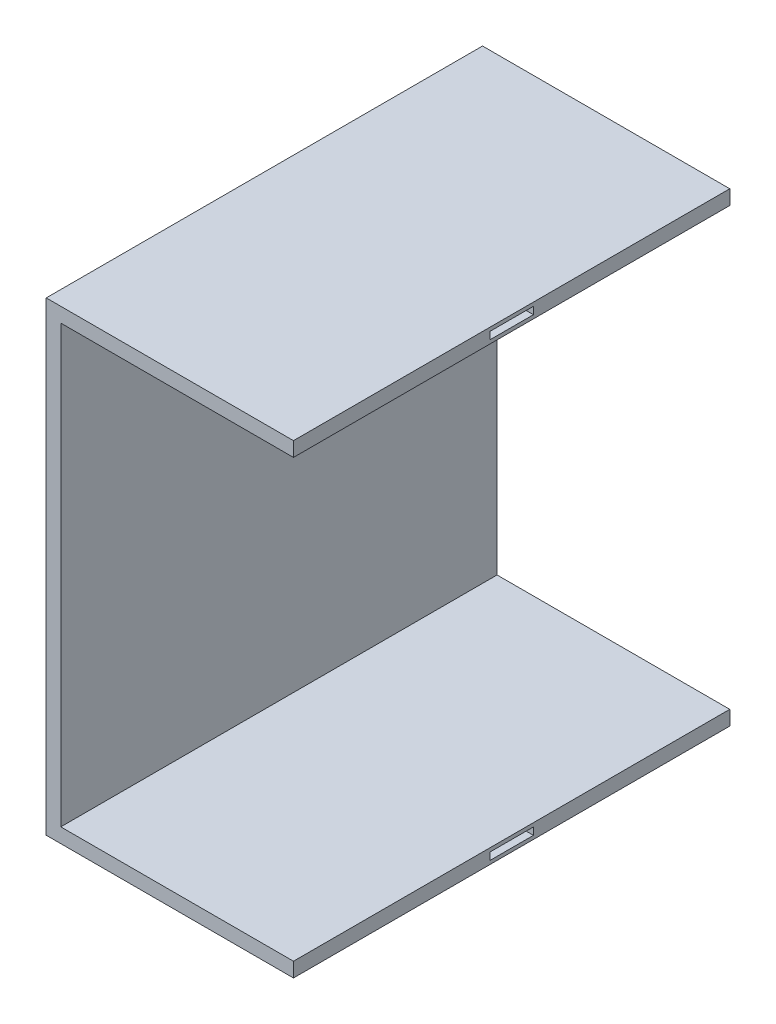
ISO-10303-21;
HEADER;
FILE_DESCRIPTION(('STEP AP214'),'2;1');
FILE_NAME('part.step','',(''),(''),'','','');
FILE_SCHEMA(('AUTOMOTIVE_DESIGN { 1 0 10303 214 1 1 1 1 }'));
ENDSEC;
DATA;
#1=APPLICATION_CONTEXT('core data for automotive mechanical design processes');
#2=APPLICATION_PROTOCOL_DEFINITION('international standard','automotive_design',2000,#1);
#3=PRODUCT_CONTEXT('',#1,'mechanical');
#4=PRODUCT('Part','Part','',(#3));
#5=PRODUCT_RELATED_PRODUCT_CATEGORY('part','',(#4));
#6=PRODUCT_DEFINITION_FORMATION('','',#4);
#7=PRODUCT_DEFINITION_CONTEXT('part definition',#1,'design');
#8=PRODUCT_DEFINITION('design','',#6,#7);
#9=PRODUCT_DEFINITION_SHAPE('','',#8);
#10=(LENGTH_UNIT() NAMED_UNIT(*) SI_UNIT(.MILLI.,.METRE.));
#11=(NAMED_UNIT(*) PLANE_ANGLE_UNIT() SI_UNIT($,.RADIAN.));
#12=(NAMED_UNIT(*) SI_UNIT($,.STERADIAN.) SOLID_ANGLE_UNIT());
#13=UNCERTAINTY_MEASURE_WITH_UNIT(LENGTH_MEASURE(1.E-05),#10,'distance_accuracy_value','');
#14=(GEOMETRIC_REPRESENTATION_CONTEXT(3) GLOBAL_UNCERTAINTY_ASSIGNED_CONTEXT((#13)) GLOBAL_UNIT_ASSIGNED_CONTEXT((#10,
#11,#12)) REPRESENTATION_CONTEXT('',''));
#15=CARTESIAN_POINT('',(0.,0.,0.));
#16=DIRECTION('',(0.,0.,1.));
#17=DIRECTION('',(1.,0.,0.));
#18=AXIS2_PLACEMENT_3D('',#15,#16,#17);
#19=CARTESIAN_POINT('',(0.,32.,15.));
#20=DIRECTION('',(1.,0.,0.));
#21=DIRECTION('',(0.,0.,-1.));
#22=AXIS2_PLACEMENT_3D('',#19,#20,#21);
#23=PLANE('',#22);
#24=CARTESIAN_POINT('',(0.,16.,0.));
#25=DIRECTION('',(1.,0.,0.));
#26=DIRECTION('',(0.,0.,-1.));
#27=AXIS2_PLACEMENT_3D('',#24,#25,#26);
#28=CIRCLE('',#27,0.500000000000001);
#29=CARTESIAN_POINT('',(0.,16.,-0.500000000000001));
#30=VERTEX_POINT('',#29);
#31=EDGE_CURVE('E37',#30,#30,#28,.T.);
#32=ORIENTED_EDGE('',*,*,#31,.T.);
#33=EDGE_LOOP('',(#32));
#34=FACE_BOUND('',#33,.T.);
#35=DIRECTION('',(0.,-1.,0.));
#36=VECTOR('',#35,1.);
#37=CARTESIAN_POINT('',(0.,32.,-15.));
#38=LINE('',#37,#36);
#39=CARTESIAN_POINT('',(0.,32.,-15.));
#40=VERTEX_POINT('',#39);
#41=CARTESIAN_POINT('',(0.,0.,-15.));
#42=VERTEX_POINT('',#41);
#43=EDGE_CURVE('E212',#40,#42,#38,.T.);
#44=ORIENTED_EDGE('',*,*,#43,.T.);
#45=DIRECTION('',(0.,0.,-1.));
#46=VECTOR('',#45,1.);
#47=CARTESIAN_POINT('',(0.,0.,15.));
#48=LINE('',#47,#46);
#49=CARTESIAN_POINT('',(0.,0.,15.));
#50=VERTEX_POINT('',#49);
#51=EDGE_CURVE('E11',#50,#42,#48,.T.);
#52=ORIENTED_EDGE('',*,*,#51,.F.);
#53=DIRECTION('',(0.,-1.,0.));
#54=VECTOR('',#53,1.);
#55=CARTESIAN_POINT('',(0.,32.,15.));
#56=LINE('',#55,#54);
#57=CARTESIAN_POINT('',(0.,32.,15.));
#58=VERTEX_POINT('',#57);
#59=EDGE_CURVE('E218',#58,#50,#56,.T.);
#60=ORIENTED_EDGE('',*,*,#59,.F.);
#61=DIRECTION('',(0.,0.,-1.));
#62=VECTOR('',#61,1.);
#63=CARTESIAN_POINT('',(0.,32.,15.));
#64=LINE('',#63,#62);
#65=EDGE_CURVE('E236',#58,#40,#64,.T.);
#66=ORIENTED_EDGE('',*,*,#65,.T.);
#67=EDGE_LOOP('',(#44,#52,#60,#66));
#68=FACE_BOUND('',#67,.T.);
#69=ADVANCED_FACE('F34',(#34,#68),#23,.F.);
#70=CARTESIAN_POINT('',(0.,0.,15.));
#71=DIRECTION('',(0.,1.,0.));
#72=DIRECTION('',(0.,0.,1.));
#73=AXIS2_PLACEMENT_3D('',#70,#71,#72);
#74=PLANE('',#73);
#75=DIRECTION('',(1.,0.,0.));
#76=VECTOR('',#75,1.);
#77=CARTESIAN_POINT('',(0.,0.,-15.));
#78=LINE('',#77,#76);
#79=CARTESIAN_POINT('',(17.,0.,-15.));
#80=VERTEX_POINT('',#79);
#81=EDGE_CURVE('E239',#42,#80,#78,.T.);
#82=ORIENTED_EDGE('',*,*,#81,.T.);
#83=DIRECTION('',(0.,0.,-1.));
#84=VECTOR('',#83,1.);
#85=CARTESIAN_POINT('',(17.,0.,15.));
#86=LINE('',#85,#84);
#87=CARTESIAN_POINT('',(17.,0.,15.));
#88=VERTEX_POINT('',#87);
#89=EDGE_CURVE('E42',#88,#80,#86,.T.);
#90=ORIENTED_EDGE('',*,*,#89,.F.);
#91=DIRECTION('',(1.,0.,0.));
#92=VECTOR('',#91,1.);
#93=CARTESIAN_POINT('',(0.,0.,15.));
#94=LINE('',#93,#92);
#95=EDGE_CURVE('E221',#50,#88,#94,.T.);
#96=ORIENTED_EDGE('',*,*,#95,.F.);
#97=ORIENTED_EDGE('',*,*,#51,.T.);
#98=EDGE_LOOP('',(#82,#90,#96,#97));
#99=FACE_BOUND('',#98,.T.);
#100=ADVANCED_FACE('F297',(#99),#74,.F.);
#101=CARTESIAN_POINT('',(17.,0.,15.));
#102=DIRECTION('',(-1.,0.,0.));
#103=DIRECTION('',(0.,0.,1.));
#104=AXIS2_PLACEMENT_3D('',#101,#102,#103);
#105=PLANE('',#104);
#106=DIRECTION('',(0.,0.,-1.));
#107=VECTOR('',#106,1.);
#108=CARTESIAN_POINT('',(17.,0.245,1.5));
#109=LINE('',#108,#107);
#110=CARTESIAN_POINT('',(17.,0.245,1.5));
#111=VERTEX_POINT('',#110);
#112=CARTESIAN_POINT('',(17.,0.245,-1.5));
#113=VERTEX_POINT('',#112);
#114=EDGE_CURVE('E202',#111,#113,#109,.T.);
#115=ORIENTED_EDGE('',*,*,#114,.F.);
#116=DIRECTION('',(0.,-1.,0.));
#117=VECTOR('',#116,1.);
#118=CARTESIAN_POINT('',(17.,0.745,1.5));
#119=LINE('',#118,#117);
#120=CARTESIAN_POINT('',(17.,0.745,1.5));
#121=VERTEX_POINT('',#120);
#122=EDGE_CURVE('E57',#121,#111,#119,.T.);
#123=ORIENTED_EDGE('',*,*,#122,.F.);
#124=DIRECTION('',(0.,0.,1.));
#125=VECTOR('',#124,1.);
#126=CARTESIAN_POINT('',(17.,0.745,1.5));
#127=LINE('',#126,#125);
#128=CARTESIAN_POINT('',(17.,0.745,-1.5));
#129=VERTEX_POINT('',#128);
#130=EDGE_CURVE('E191',#129,#121,#127,.T.);
#131=ORIENTED_EDGE('',*,*,#130,.F.);
#132=DIRECTION('',(0.,1.,0.));
#133=VECTOR('',#132,1.);
#134=CARTESIAN_POINT('',(17.,0.745,-1.5));
#135=LINE('',#134,#133);
#136=EDGE_CURVE('E205',#113,#129,#135,.T.);
#137=ORIENTED_EDGE('',*,*,#136,.F.);
#138=EDGE_LOOP('',(#115,#123,#131,#137));
#139=FACE_BOUND('',#138,.T.);
#140=DIRECTION('',(0.,1.,0.));
#141=VECTOR('',#140,1.);
#142=CARTESIAN_POINT('',(17.,0.,-15.));
#143=LINE('',#142,#141);
#144=CARTESIAN_POINT('',(17.,1.,-15.));
#145=VERTEX_POINT('',#144);
#146=EDGE_CURVE('E241',#80,#145,#143,.T.);
#147=ORIENTED_EDGE('',*,*,#146,.T.);
#148=DIRECTION('',(0.,0.,-1.));
#149=VECTOR('',#148,1.);
#150=CARTESIAN_POINT('',(17.,1.,15.));
#151=LINE('',#150,#149);
#152=CARTESIAN_POINT('',(17.,1.,15.));
#153=VERTEX_POINT('',#152);
#154=EDGE_CURVE('E266',#153,#145,#151,.T.);
#155=ORIENTED_EDGE('',*,*,#154,.F.);
#156=DIRECTION('',(0.,1.,0.));
#157=VECTOR('',#156,1.);
#158=CARTESIAN_POINT('',(17.,0.,15.));
#159=LINE('',#158,#157);
#160=EDGE_CURVE('E224',#88,#153,#159,.T.);
#161=ORIENTED_EDGE('',*,*,#160,.F.);
#162=ORIENTED_EDGE('',*,*,#89,.T.);
#163=EDGE_LOOP('',(#147,#155,#161,#162));
#164=FACE_BOUND('',#163,.T.);
#165=ADVANCED_FACE('F274',(#139,#164),#105,.F.);
#166=CARTESIAN_POINT('',(17.,1.,15.));
#167=DIRECTION('',(0.,-1.,0.));
#168=DIRECTION('',(1.,0.,0.));
#169=AXIS2_PLACEMENT_3D('',#166,#167,#168);
#170=PLANE('',#169);
#171=DIRECTION('',(-1.,0.,0.));
#172=VECTOR('',#171,1.);
#173=CARTESIAN_POINT('',(17.,1.,-15.));
#174=LINE('',#173,#172);
#175=CARTESIAN_POINT('',(1.,1.,-15.));
#176=VERTEX_POINT('',#175);
#177=EDGE_CURVE('E243',#145,#176,#174,.T.);
#178=ORIENTED_EDGE('',*,*,#177,.T.);
#179=DIRECTION('',(0.,0.,-1.));
#180=VECTOR('',#179,1.);
#181=CARTESIAN_POINT('',(1.,1.,15.));
#182=LINE('',#181,#180);
#183=CARTESIAN_POINT('',(1.,1.,15.));
#184=VERTEX_POINT('',#183);
#185=EDGE_CURVE('E263',#184,#176,#182,.T.);
#186=ORIENTED_EDGE('',*,*,#185,.F.);
#187=DIRECTION('',(-1.,0.,0.));
#188=VECTOR('',#187,1.);
#189=CARTESIAN_POINT('',(17.,1.,15.));
#190=LINE('',#189,#188);
#191=EDGE_CURVE('E226',#153,#184,#190,.T.);
#192=ORIENTED_EDGE('',*,*,#191,.F.);
#193=ORIENTED_EDGE('',*,*,#154,.T.);
#194=EDGE_LOOP('',(#178,#186,#192,#193));
#195=FACE_BOUND('',#194,.T.);
#196=ADVANCED_FACE('F285',(#195),#170,.F.);
#197=CARTESIAN_POINT('',(1.,1.,15.));
#198=DIRECTION('',(-1.,0.,0.));
#199=DIRECTION('',(0.,0.,1.));
#200=AXIS2_PLACEMENT_3D('',#197,#198,#199);
#201=PLANE('',#200);
#202=DIRECTION('',(0.,1.,0.));
#203=VECTOR('',#202,1.);
#204=CARTESIAN_POINT('',(1.,1.,-15.));
#205=LINE('',#204,#203);
#206=CARTESIAN_POINT('',(1.,31.,-15.));
#207=VERTEX_POINT('',#206);
#208=EDGE_CURVE('E245',#176,#207,#205,.T.);
#209=ORIENTED_EDGE('',*,*,#208,.T.);
#210=DIRECTION('',(0.,0.,-1.));
#211=VECTOR('',#210,1.);
#212=CARTESIAN_POINT('',(1.,31.,15.));
#213=LINE('',#212,#211);
#214=CARTESIAN_POINT('',(1.,31.,15.));
#215=VERTEX_POINT('',#214);
#216=EDGE_CURVE('E260',#215,#207,#213,.T.);
#217=ORIENTED_EDGE('',*,*,#216,.F.);
#218=DIRECTION('',(0.,1.,0.));
#219=VECTOR('',#218,1.);
#220=CARTESIAN_POINT('',(1.,1.,15.));
#221=LINE('',#220,#219);
#222=EDGE_CURVE('E228',#184,#215,#221,.T.);
#223=ORIENTED_EDGE('',*,*,#222,.F.);
#224=ORIENTED_EDGE('',*,*,#185,.T.);
#225=EDGE_LOOP('',(#209,#217,#223,#224));
#226=FACE_BOUND('',#225,.T.);
#227=ADVANCED_FACE('F289',(#226),#201,.F.);
#228=CARTESIAN_POINT('',(1.,31.,15.));
#229=DIRECTION('',(0.,1.,0.));
#230=DIRECTION('',(0.,0.,1.));
#231=AXIS2_PLACEMENT_3D('',#228,#229,#230);
#232=PLANE('',#231);
#233=DIRECTION('',(1.,0.,0.));
#234=VECTOR('',#233,1.);
#235=CARTESIAN_POINT('',(1.,31.,-15.));
#236=LINE('',#235,#234);
#237=CARTESIAN_POINT('',(17.,31.,-15.));
#238=VERTEX_POINT('',#237);
#239=EDGE_CURVE('E247',#207,#238,#236,.T.);
#240=ORIENTED_EDGE('',*,*,#239,.T.);
#241=DIRECTION('',(0.,0.,-1.));
#242=VECTOR('',#241,1.);
#243=CARTESIAN_POINT('',(17.,31.,15.));
#244=LINE('',#243,#242);
#245=CARTESIAN_POINT('',(17.,31.,15.));
#246=VERTEX_POINT('',#245);
#247=EDGE_CURVE('E257',#246,#238,#244,.T.);
#248=ORIENTED_EDGE('',*,*,#247,.F.);
#249=DIRECTION('',(1.,0.,0.));
#250=VECTOR('',#249,1.);
#251=CARTESIAN_POINT('',(1.,31.,15.));
#252=LINE('',#251,#250);
#253=EDGE_CURVE('E230',#215,#246,#252,.T.);
#254=ORIENTED_EDGE('',*,*,#253,.F.);
#255=ORIENTED_EDGE('',*,*,#216,.T.);
#256=EDGE_LOOP('',(#240,#248,#254,#255));
#257=FACE_BOUND('',#256,.T.);
#258=ADVANCED_FACE('F310',(#257),#232,.F.);
#259=CARTESIAN_POINT('',(17.,31.,15.));
#260=DIRECTION('',(-1.,0.,0.));
#261=DIRECTION('',(0.,0.,1.));
#262=AXIS2_PLACEMENT_3D('',#259,#260,#261);
#263=PLANE('',#262);
#264=DIRECTION('',(0.,0.,-1.));
#265=VECTOR('',#264,1.);
#266=CARTESIAN_POINT('',(17.,31.25,1.5));
#267=LINE('',#266,#265);
#268=CARTESIAN_POINT('',(17.,31.25,1.5));
#269=VERTEX_POINT('',#268);
#270=CARTESIAN_POINT('',(17.,31.25,-1.5));
#271=VERTEX_POINT('',#270);
#272=EDGE_CURVE('E178',#269,#271,#267,.T.);
#273=ORIENTED_EDGE('',*,*,#272,.F.);
#274=DIRECTION('',(0.,-1.,0.));
#275=VECTOR('',#274,1.);
#276=CARTESIAN_POINT('',(17.,31.75,1.5));
#277=LINE('',#276,#275);
#278=CARTESIAN_POINT('',(17.,31.75,1.5));
#279=VERTEX_POINT('',#278);
#280=EDGE_CURVE('E49',#279,#269,#277,.T.);
#281=ORIENTED_EDGE('',*,*,#280,.F.);
#282=DIRECTION('',(0.,0.,1.));
#283=VECTOR('',#282,1.);
#284=CARTESIAN_POINT('',(17.,31.75,1.5));
#285=LINE('',#284,#283);
#286=CARTESIAN_POINT('',(17.,31.75,-1.5));
#287=VERTEX_POINT('',#286);
#288=EDGE_CURVE('E167',#287,#279,#285,.T.);
#289=ORIENTED_EDGE('',*,*,#288,.F.);
#290=DIRECTION('',(0.,1.,0.));
#291=VECTOR('',#290,1.);
#292=CARTESIAN_POINT('',(17.,31.75,-1.5));
#293=LINE('',#292,#291);
#294=EDGE_CURVE('E170',#271,#287,#293,.T.);
#295=ORIENTED_EDGE('',*,*,#294,.F.);
#296=EDGE_LOOP('',(#273,#281,#289,#295));
#297=FACE_BOUND('',#296,.T.);
#298=DIRECTION('',(0.,1.,0.));
#299=VECTOR('',#298,1.);
#300=CARTESIAN_POINT('',(17.,31.,-15.));
#301=LINE('',#300,#299);
#302=CARTESIAN_POINT('',(17.,32.,-15.));
#303=VERTEX_POINT('',#302);
#304=EDGE_CURVE('E249',#238,#303,#301,.T.);
#305=ORIENTED_EDGE('',*,*,#304,.T.);
#306=DIRECTION('',(0.,0.,-1.));
#307=VECTOR('',#306,1.);
#308=CARTESIAN_POINT('',(17.,32.,15.));
#309=LINE('',#308,#307);
#310=CARTESIAN_POINT('',(17.,32.,15.));
#311=VERTEX_POINT('',#310);
#312=EDGE_CURVE('E254',#311,#303,#309,.T.);
#313=ORIENTED_EDGE('',*,*,#312,.F.);
#314=DIRECTION('',(0.,1.,0.));
#315=VECTOR('',#314,1.);
#316=CARTESIAN_POINT('',(17.,31.,15.));
#317=LINE('',#316,#315);
#318=EDGE_CURVE('E232',#246,#311,#317,.T.);
#319=ORIENTED_EDGE('',*,*,#318,.F.);
#320=ORIENTED_EDGE('',*,*,#247,.T.);
#321=EDGE_LOOP('',(#305,#313,#319,#320));
#322=FACE_BOUND('',#321,.T.);
#323=ADVANCED_FACE('F308',(#297,#322),#263,.F.);
#324=CARTESIAN_POINT('',(17.,32.,15.));
#325=DIRECTION('',(0.,-1.,0.));
#326=DIRECTION('',(0.,0.,-1.));
#327=AXIS2_PLACEMENT_3D('',#324,#325,#326);
#328=PLANE('',#327);
#329=DIRECTION('',(-1.,0.,0.));
#330=VECTOR('',#329,1.);
#331=CARTESIAN_POINT('',(17.,32.,-15.));
#332=LINE('',#331,#330);
#333=EDGE_CURVE('E222',#303,#40,#332,.T.);
#334=ORIENTED_EDGE('',*,*,#333,.T.);
#335=ORIENTED_EDGE('',*,*,#65,.F.);
#336=DIRECTION('',(-1.,0.,0.));
#337=VECTOR('',#336,1.);
#338=CARTESIAN_POINT('',(17.,32.,15.));
#339=LINE('',#338,#337);
#340=EDGE_CURVE('E234',#311,#58,#339,.T.);
#341=ORIENTED_EDGE('',*,*,#340,.F.);
#342=ORIENTED_EDGE('',*,*,#312,.T.);
#343=EDGE_LOOP('',(#334,#335,#341,#342));
#344=FACE_BOUND('',#343,.T.);
#345=ADVANCED_FACE('F303',(#344),#328,.F.);
#346=CARTESIAN_POINT('',(0.,0.,15.));
#347=DIRECTION('',(0.,0.,1.));
#348=DIRECTION('',(1.,0.,0.));
#349=AXIS2_PLACEMENT_3D('',#346,#347,#348);
#350=PLANE('',#349);
#351=ORIENTED_EDGE('',*,*,#59,.T.);
#352=ORIENTED_EDGE('',*,*,#95,.T.);
#353=ORIENTED_EDGE('',*,*,#160,.T.);
#354=ORIENTED_EDGE('',*,*,#191,.T.);
#355=ORIENTED_EDGE('',*,*,#222,.T.);
#356=ORIENTED_EDGE('',*,*,#253,.T.);
#357=ORIENTED_EDGE('',*,*,#318,.T.);
#358=ORIENTED_EDGE('',*,*,#340,.T.);
#359=EDGE_LOOP('',(#351,#352,#353,#354,#355,#356,#357,#358));
#360=FACE_BOUND('',#359,.T.);
#361=ADVANCED_FACE('F293',(#360),#350,.T.);
#362=CARTESIAN_POINT('',(0.,0.,-15.));
#363=DIRECTION('',(0.,0.,1.));
#364=DIRECTION('',(1.,0.,0.));
#365=AXIS2_PLACEMENT_3D('',#362,#363,#364);
#366=PLANE('',#365);
#367=ORIENTED_EDGE('',*,*,#43,.F.);
#368=ORIENTED_EDGE('',*,*,#333,.F.);
#369=ORIENTED_EDGE('',*,*,#304,.F.);
#370=ORIENTED_EDGE('',*,*,#239,.F.);
#371=ORIENTED_EDGE('',*,*,#208,.F.);
#372=ORIENTED_EDGE('',*,*,#177,.F.);
#373=ORIENTED_EDGE('',*,*,#146,.F.);
#374=ORIENTED_EDGE('',*,*,#81,.F.);
#375=EDGE_LOOP('',(#367,#368,#369,#370,#371,#372,#373,#374));
#376=FACE_BOUND('',#375,.T.);
#377=ADVANCED_FACE('F280',(#376),#366,.F.);
#378=CARTESIAN_POINT('',(16.,0.745,1.5));
#379=DIRECTION('',(0.,0.,1.));
#380=DIRECTION('',(1.,0.,0.));
#381=AXIS2_PLACEMENT_3D('',#378,#379,#380);
#382=PLANE('',#381);
#383=ORIENTED_EDGE('',*,*,#122,.T.);
#384=DIRECTION('',(1.,0.,0.));
#385=VECTOR('',#384,1.);
#386=CARTESIAN_POINT('',(16.,0.245,1.5));
#387=LINE('',#386,#385);
#388=CARTESIAN_POINT('',(16.,0.245,1.5));
#389=VERTEX_POINT('',#388);
#390=EDGE_CURVE('E200',#389,#111,#387,.T.);
#391=ORIENTED_EDGE('',*,*,#390,.F.);
#392=DIRECTION('',(0.,-1.,0.));
#393=VECTOR('',#392,1.);
#394=CARTESIAN_POINT('',(16.,0.745,1.5));
#395=LINE('',#394,#393);
#396=CARTESIAN_POINT('',(16.,0.745,1.5));
#397=VERTEX_POINT('',#396);
#398=EDGE_CURVE('E187',#397,#389,#395,.T.);
#399=ORIENTED_EDGE('',*,*,#398,.F.);
#400=DIRECTION('',(1.,0.,0.));
#401=VECTOR('',#400,1.);
#402=CARTESIAN_POINT('',(16.,0.745,1.5));
#403=LINE('',#402,#401);
#404=EDGE_CURVE('E210',#397,#121,#403,.T.);
#405=ORIENTED_EDGE('',*,*,#404,.T.);
#406=EDGE_LOOP('',(#383,#391,#399,#405));
#407=FACE_BOUND('',#406,.T.);
#408=ADVANCED_FACE('F364',(#407),#382,.F.);
#409=CARTESIAN_POINT('',(16.,0.745,1.5));
#410=DIRECTION('',(0.,1.,0.));
#411=DIRECTION('',(0.,0.,1.));
#412=AXIS2_PLACEMENT_3D('',#409,#410,#411);
#413=PLANE('',#412);
#414=ORIENTED_EDGE('',*,*,#130,.T.);
#415=ORIENTED_EDGE('',*,*,#404,.F.);
#416=DIRECTION('',(0.,0.,1.));
#417=VECTOR('',#416,1.);
#418=CARTESIAN_POINT('',(16.,0.745,1.5));
#419=LINE('',#418,#417);
#420=CARTESIAN_POINT('',(16.,0.745,-1.5));
#421=VERTEX_POINT('',#420);
#422=EDGE_CURVE('E197',#421,#397,#419,.T.);
#423=ORIENTED_EDGE('',*,*,#422,.F.);
#424=DIRECTION('',(1.,0.,0.));
#425=VECTOR('',#424,1.);
#426=CARTESIAN_POINT('',(16.,0.745,-1.5));
#427=LINE('',#426,#425);
#428=EDGE_CURVE('E213',#421,#129,#427,.T.);
#429=ORIENTED_EDGE('',*,*,#428,.T.);
#430=EDGE_LOOP('',(#414,#415,#423,#429));
#431=FACE_BOUND('',#430,.T.);
#432=ADVANCED_FACE('F360',(#431),#413,.F.);
#433=CARTESIAN_POINT('',(16.,0.745,-1.5));
#434=DIRECTION('',(0.,0.,-1.));
#435=DIRECTION('',(-1.,0.,0.));
#436=AXIS2_PLACEMENT_3D('',#433,#434,#435);
#437=PLANE('',#436);
#438=ORIENTED_EDGE('',*,*,#136,.T.);
#439=ORIENTED_EDGE('',*,*,#428,.F.);
#440=DIRECTION('',(0.,1.,0.));
#441=VECTOR('',#440,1.);
#442=CARTESIAN_POINT('',(16.,0.745,-1.5));
#443=LINE('',#442,#441);
#444=CARTESIAN_POINT('',(16.,0.245,-1.5));
#445=VERTEX_POINT('',#444);
#446=EDGE_CURVE('E194',#445,#421,#443,.T.);
#447=ORIENTED_EDGE('',*,*,#446,.F.);
#448=DIRECTION('',(1.,0.,0.));
#449=VECTOR('',#448,1.);
#450=CARTESIAN_POINT('',(16.,0.245,-1.5));
#451=LINE('',#450,#449);
#452=EDGE_CURVE('E215',#445,#113,#451,.T.);
#453=ORIENTED_EDGE('',*,*,#452,.T.);
#454=EDGE_LOOP('',(#438,#439,#447,#453));
#455=FACE_BOUND('',#454,.T.);
#456=ADVANCED_FACE('F363',(#455),#437,.F.);
#457=CARTESIAN_POINT('',(16.,0.245,1.5));
#458=DIRECTION('',(0.,-1.,0.));
#459=DIRECTION('',(0.,0.,-1.));
#460=AXIS2_PLACEMENT_3D('',#457,#458,#459);
#461=PLANE('',#460);
#462=ORIENTED_EDGE('',*,*,#114,.T.);
#463=ORIENTED_EDGE('',*,*,#452,.F.);
#464=DIRECTION('',(0.,0.,-1.));
#465=VECTOR('',#464,1.);
#466=CARTESIAN_POINT('',(16.,0.245,1.5));
#467=LINE('',#466,#465);
#468=EDGE_CURVE('E190',#389,#445,#467,.T.);
#469=ORIENTED_EDGE('',*,*,#468,.F.);
#470=ORIENTED_EDGE('',*,*,#390,.T.);
#471=EDGE_LOOP('',(#462,#463,#469,#470));
#472=FACE_BOUND('',#471,.T.);
#473=ADVANCED_FACE('F358',(#472),#461,.F.);
#474=CARTESIAN_POINT('',(16.,0.,0.));
#475=DIRECTION('',(1.,0.,0.));
#476=DIRECTION('',(0.,0.,-1.));
#477=AXIS2_PLACEMENT_3D('',#474,#475,#476);
#478=PLANE('',#477);
#479=ORIENTED_EDGE('',*,*,#398,.T.);
#480=ORIENTED_EDGE('',*,*,#468,.T.);
#481=ORIENTED_EDGE('',*,*,#446,.T.);
#482=ORIENTED_EDGE('',*,*,#422,.T.);
#483=EDGE_LOOP('',(#479,#480,#481,#482));
#484=FACE_BOUND('',#483,.T.);
#485=ADVANCED_FACE('F355',(#484),#478,.T.);
#486=CARTESIAN_POINT('',(16.,31.75,1.5));
#487=DIRECTION('',(0.,0.,1.));
#488=DIRECTION('',(1.,0.,0.));
#489=AXIS2_PLACEMENT_3D('',#486,#487,#488);
#490=PLANE('',#489);
#491=ORIENTED_EDGE('',*,*,#280,.T.);
#492=DIRECTION('',(1.,0.,0.));
#493=VECTOR('',#492,1.);
#494=CARTESIAN_POINT('',(16.,31.25,1.5));
#495=LINE('',#494,#493);
#496=CARTESIAN_POINT('',(16.,31.25,1.5));
#497=VERTEX_POINT('',#496);
#498=EDGE_CURVE('E145',#497,#269,#495,.T.);
#499=ORIENTED_EDGE('',*,*,#498,.F.);
#500=DIRECTION('',(0.,-1.,0.));
#501=VECTOR('',#500,1.);
#502=CARTESIAN_POINT('',(16.,31.75,1.5));
#503=LINE('',#502,#501);
#504=CARTESIAN_POINT('',(16.,31.75,1.5));
#505=VERTEX_POINT('',#504);
#506=EDGE_CURVE('E149',#505,#497,#503,.T.);
#507=ORIENTED_EDGE('',*,*,#506,.F.);
#508=DIRECTION('',(1.,0.,0.));
#509=VECTOR('',#508,1.);
#510=CARTESIAN_POINT('',(16.,31.75,1.5));
#511=LINE('',#510,#509);
#512=EDGE_CURVE('E182',#505,#279,#511,.T.);
#513=ORIENTED_EDGE('',*,*,#512,.T.);
#514=EDGE_LOOP('',(#491,#499,#507,#513));
#515=FACE_BOUND('',#514,.T.);
#516=ADVANCED_FACE('F147',(#515),#490,.F.);
#517=CARTESIAN_POINT('',(16.,31.75,1.5));
#518=DIRECTION('',(0.,1.,0.));
#519=DIRECTION('',(0.,0.,1.));
#520=AXIS2_PLACEMENT_3D('',#517,#518,#519);
#521=PLANE('',#520);
#522=ORIENTED_EDGE('',*,*,#288,.T.);
#523=ORIENTED_EDGE('',*,*,#512,.F.);
#524=DIRECTION('',(0.,0.,1.));
#525=VECTOR('',#524,1.);
#526=CARTESIAN_POINT('',(16.,31.75,1.5));
#527=LINE('',#526,#525);
#528=CARTESIAN_POINT('',(16.,31.75,-1.5));
#529=VERTEX_POINT('',#528);
#530=EDGE_CURVE('E155',#529,#505,#527,.T.);
#531=ORIENTED_EDGE('',*,*,#530,.F.);
#532=DIRECTION('',(1.,0.,0.));
#533=VECTOR('',#532,1.);
#534=CARTESIAN_POINT('',(16.,31.75,-1.5));
#535=LINE('',#534,#533);
#536=EDGE_CURVE('E184',#529,#287,#535,.T.);
#537=ORIENTED_EDGE('',*,*,#536,.T.);
#538=EDGE_LOOP('',(#522,#523,#531,#537));
#539=FACE_BOUND('',#538,.T.);
#540=ADVANCED_FACE('F343',(#539),#521,.F.);
#541=CARTESIAN_POINT('',(16.,31.75,-1.5));
#542=DIRECTION('',(0.,0.,-1.));
#543=DIRECTION('',(-1.,0.,0.));
#544=AXIS2_PLACEMENT_3D('',#541,#542,#543);
#545=PLANE('',#544);
#546=ORIENTED_EDGE('',*,*,#294,.T.);
#547=ORIENTED_EDGE('',*,*,#536,.F.);
#548=DIRECTION('',(0.,1.,0.));
#549=VECTOR('',#548,1.);
#550=CARTESIAN_POINT('',(16.,31.75,-1.5));
#551=LINE('',#550,#549);
#552=CARTESIAN_POINT('',(16.,31.25,-1.5));
#553=VERTEX_POINT('',#552);
#554=EDGE_CURVE('E163',#553,#529,#551,.T.);
#555=ORIENTED_EDGE('',*,*,#554,.F.);
#556=DIRECTION('',(1.,0.,0.));
#557=VECTOR('',#556,1.);
#558=CARTESIAN_POINT('',(16.,31.25,-1.5));
#559=LINE('',#558,#557);
#560=EDGE_CURVE('E154',#553,#271,#559,.T.);
#561=ORIENTED_EDGE('',*,*,#560,.T.);
#562=EDGE_LOOP('',(#546,#547,#555,#561));
#563=FACE_BOUND('',#562,.T.);
#564=ADVANCED_FACE('F346',(#563),#545,.F.);
#565=CARTESIAN_POINT('',(16.,31.25,1.5));
#566=DIRECTION('',(0.,-1.,0.));
#567=DIRECTION('',(0.,0.,-1.));
#568=AXIS2_PLACEMENT_3D('',#565,#566,#567);
#569=PLANE('',#568);
#570=ORIENTED_EDGE('',*,*,#272,.T.);
#571=ORIENTED_EDGE('',*,*,#560,.F.);
#572=DIRECTION('',(0.,0.,-1.));
#573=VECTOR('',#572,1.);
#574=CARTESIAN_POINT('',(16.,31.25,1.5));
#575=LINE('',#574,#573);
#576=EDGE_CURVE('E158',#497,#553,#575,.T.);
#577=ORIENTED_EDGE('',*,*,#576,.F.);
#578=ORIENTED_EDGE('',*,*,#498,.T.);
#579=EDGE_LOOP('',(#570,#571,#577,#578));
#580=FACE_BOUND('',#579,.T.);
#581=ADVANCED_FACE('F159',(#580),#569,.F.);
#582=CARTESIAN_POINT('',(16.,0.,0.));
#583=DIRECTION('',(1.,0.,0.));
#584=DIRECTION('',(0.,0.,-1.));
#585=AXIS2_PLACEMENT_3D('',#582,#583,#584);
#586=PLANE('',#585);
#587=ORIENTED_EDGE('',*,*,#506,.T.);
#588=ORIENTED_EDGE('',*,*,#576,.T.);
#589=ORIENTED_EDGE('',*,*,#554,.T.);
#590=ORIENTED_EDGE('',*,*,#530,.T.);
#591=EDGE_LOOP('',(#587,#588,#589,#590));
#592=FACE_BOUND('',#591,.T.);
#593=ADVANCED_FACE('F165',(#592),#586,.T.);
#594=CARTESIAN_POINT('',(0.249999999999999,16.,0.));
#595=DIRECTION('',(-1.,0.,0.));
#596=DIRECTION('',(0.,-1.,0.));
#597=AXIS2_PLACEMENT_3D('',#594,#595,#596);
#598=CYLINDRICAL_SURFACE('',#597,0.500000000000001);
#599=CARTESIAN_POINT('',(0.249999999999999,16.,0.));
#600=DIRECTION('',(-1.,0.,0.));
#601=DIRECTION('',(0.,-1.,0.));
#602=AXIS2_PLACEMENT_3D('',#599,#600,#601);
#603=CIRCLE('',#602,0.500000000000001);
#604=CARTESIAN_POINT('',(0.249999999999999,15.5,0.));
#605=VERTEX_POINT('',#604);
#606=EDGE_CURVE('E173',#605,#605,#603,.T.);
#607=ORIENTED_EDGE('',*,*,#606,.F.);
#608=EDGE_LOOP('',(#607));
#609=FACE_BOUND('',#608,.T.);
#610=ORIENTED_EDGE('',*,*,#31,.F.);
#611=EDGE_LOOP('',(#610));
#612=FACE_BOUND('',#611,.T.);
#613=ADVANCED_FACE('F333',(#609,#612),#598,.F.);
#614=CARTESIAN_POINT('',(0.249999999999999,16.,0.));
#615=DIRECTION('',(-1.,0.,0.));
#616=DIRECTION('',(0.,-1.,0.));
#617=AXIS2_PLACEMENT_3D('',#614,#615,#616);
#618=PLANE('',#617);
#619=ORIENTED_EDGE('',*,*,#606,.T.);
#620=EDGE_LOOP('',(#619));
#621=FACE_BOUND('',#620,.T.);
#622=ADVANCED_FACE('F331',(#621),#618,.T.);
#623=CLOSED_SHELL('',(#69,#100,#165,#196,#227,#258,#323,#345,#361,#377,#408,#432,#456,#473,#485,
#516,#540,#564,#581,#593,#613,#622));
#624=MANIFOLD_SOLID_BREP('B2',#623);
#625=ADVANCED_BREP_SHAPE_REPRESENTATION('',(#18,#624),#14);
#626=SHAPE_DEFINITION_REPRESENTATION(#9,#625);
ENDSEC;
END-ISO-10303-21;
